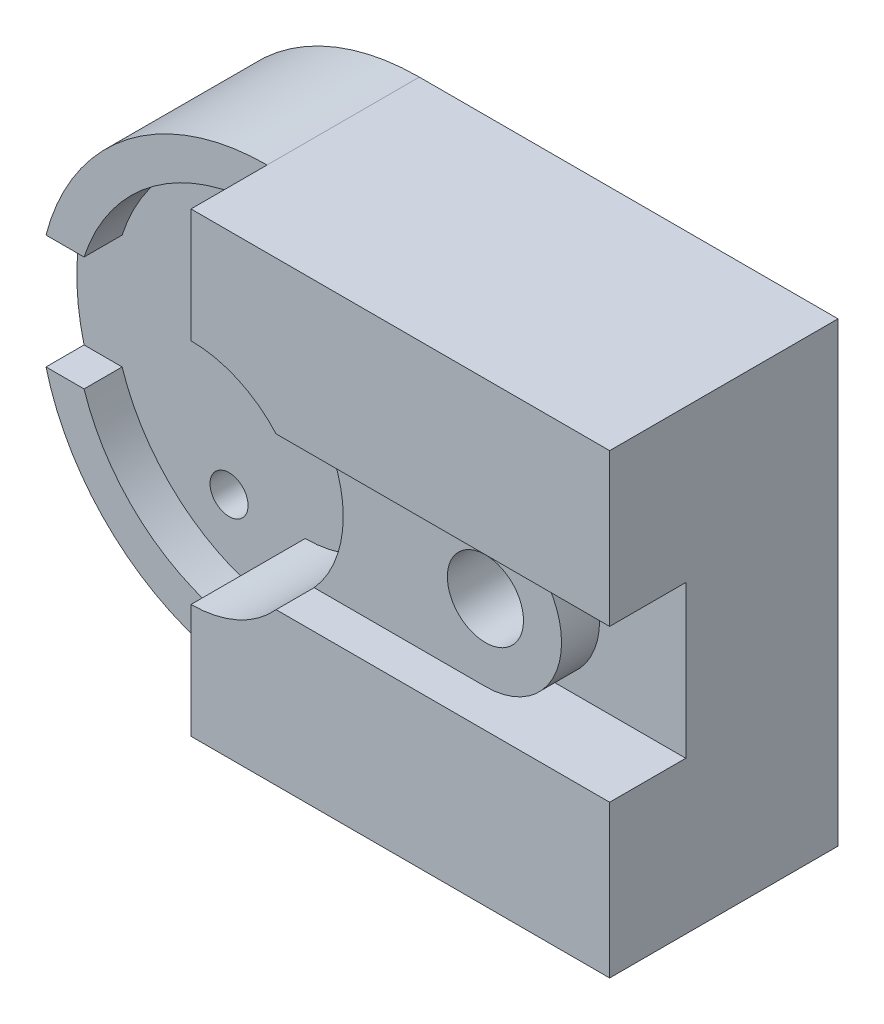
ISO-10303-21;
HEADER;
FILE_DESCRIPTION(('STEP AP214'),'2;1');
FILE_NAME('part.step','',(''),(''),'','','');
FILE_SCHEMA(('AUTOMOTIVE_DESIGN { 1 0 10303 214 1 1 1 1 }'));
ENDSEC;
DATA;
#1=APPLICATION_CONTEXT('core data for automotive mechanical design processes');
#2=APPLICATION_PROTOCOL_DEFINITION('international standard','automotive_design',2000,#1);
#3=PRODUCT_CONTEXT('',#1,'mechanical');
#4=PRODUCT('Part','Part','',(#3));
#5=PRODUCT_RELATED_PRODUCT_CATEGORY('part','',(#4));
#6=PRODUCT_DEFINITION_FORMATION('','',#4);
#7=PRODUCT_DEFINITION_CONTEXT('part definition',#1,'design');
#8=PRODUCT_DEFINITION('design','',#6,#7);
#9=PRODUCT_DEFINITION_SHAPE('','',#8);
#10=(LENGTH_UNIT() NAMED_UNIT(*) SI_UNIT(.MILLI.,.METRE.));
#11=(NAMED_UNIT(*) PLANE_ANGLE_UNIT() SI_UNIT($,.RADIAN.));
#12=(NAMED_UNIT(*) SI_UNIT($,.STERADIAN.) SOLID_ANGLE_UNIT());
#13=UNCERTAINTY_MEASURE_WITH_UNIT(LENGTH_MEASURE(1.E-05),#10,'distance_accuracy_value','');
#14=(GEOMETRIC_REPRESENTATION_CONTEXT(3) GLOBAL_UNCERTAINTY_ASSIGNED_CONTEXT((#13)) GLOBAL_UNIT_ASSIGNED_CONTEXT((#10,
#11,#12)) REPRESENTATION_CONTEXT('',''));
#15=CARTESIAN_POINT('',(0.,0.,0.));
#16=DIRECTION('',(0.,0.,1.));
#17=DIRECTION('',(1.,0.,0.));
#18=AXIS2_PLACEMENT_3D('',#15,#16,#17);
#19=CARTESIAN_POINT('',(-43.819660112501,40.,20.));
#20=DIRECTION('',(0.,1.,0.));
#21=DIRECTION('',(0.,0.,1.));
#22=AXIS2_PLACEMENT_3D('',#19,#20,#21);
#23=PLANE('',#22);
#24=DIRECTION('',(0.,0.,-1.));
#25=VECTOR('',#24,1.);
#26=CARTESIAN_POINT('',(-21.319660112501,40.,25.));
#27=LINE('',#26,#25);
#28=CARTESIAN_POINT('',(-21.319660112501,40.,25.));
#29=VERTEX_POINT('',#28);
#30=CARTESIAN_POINT('',(-21.319660112501,40.,20.));
#31=VERTEX_POINT('',#30);
#32=EDGE_CURVE('E196',#29,#31,#27,.T.);
#33=ORIENTED_EDGE('',*,*,#32,.T.);
#34=DIRECTION('',(-1.,0.,0.));
#35=VECTOR('',#34,1.);
#36=CARTESIAN_POINT('',(-43.819660112501,40.,20.));
#37=LINE('',#36,#35);
#38=CARTESIAN_POINT('',(0.,40.,20.));
#39=VERTEX_POINT('',#38);
#40=EDGE_CURVE('E190',#39,#31,#37,.T.);
#41=ORIENTED_EDGE('',*,*,#40,.F.);
#42=DIRECTION('',(0.,0.,1.));
#43=VECTOR('',#42,1.);
#44=CARTESIAN_POINT('',(0.,40.,20.));
#45=LINE('',#44,#43);
#46=CARTESIAN_POINT('',(0.,40.,30.));
#47=VERTEX_POINT('',#46);
#48=EDGE_CURVE('E184',#39,#47,#45,.T.);
#49=ORIENTED_EDGE('',*,*,#48,.T.);
#50=DIRECTION('',(-1.,0.,0.));
#51=VECTOR('',#50,1.);
#52=CARTESIAN_POINT('',(-43.819660112501,40.,30.));
#53=LINE('',#52,#51);
#54=CARTESIAN_POINT('',(-43.819660112501,40.,30.));
#55=VERTEX_POINT('',#54);
#56=EDGE_CURVE('E174',#47,#55,#53,.T.);
#57=ORIENTED_EDGE('',*,*,#56,.T.);
#58=DIRECTION('',(0.,0.,1.));
#59=VECTOR('',#58,1.);
#60=CARTESIAN_POINT('',(-43.819660112501,40.,20.));
#61=LINE('',#60,#59);
#62=CARTESIAN_POINT('',(-43.819660112501,40.,25.));
#63=VERTEX_POINT('',#62);
#64=EDGE_CURVE('E55',#63,#55,#61,.T.);
#65=ORIENTED_EDGE('',*,*,#64,.F.);
#66=DIRECTION('',(-1.,0.,0.));
#67=VECTOR('',#66,1.);
#68=CARTESIAN_POINT('',(-43.819660112501,40.,25.));
#69=LINE('',#68,#67);
#70=EDGE_CURVE('E50',#29,#63,#69,.T.);
#71=ORIENTED_EDGE('',*,*,#70,.F.);
#72=EDGE_LOOP('',(#33,#41,#49,#57,#65,#71));
#73=FACE_BOUND('',#72,.T.);
#74=ADVANCED_FACE('F33',(#73),#23,.F.);
#75=CARTESIAN_POINT('',(-55.,30.,20.));
#76=DIRECTION('',(0.,0.,-1.));
#77=DIRECTION('',(-1.,0.,0.));
#78=AXIS2_PLACEMENT_3D('',#75,#76,#77);
#79=PLANE('',#78);
#80=CARTESIAN_POINT('',(-21.319660112501,30.,20.));
#81=DIRECTION('',(0.,0.,1.));
#82=DIRECTION('',(-1.,0.,0.));
#83=AXIS2_PLACEMENT_3D('',#80,#81,#82);
#84=CIRCLE('',#83,10.);
#85=CARTESIAN_POINT('',(-21.319660112501,20.,20.));
#86=VERTEX_POINT('',#85);
#87=EDGE_CURVE('E171',#86,#31,#84,.T.);
#88=ORIENTED_EDGE('',*,*,#87,.F.);
#89=DIRECTION('',(1.,0.,0.));
#90=VECTOR('',#89,1.);
#91=CARTESIAN_POINT('',(-43.819660112501,20.,20.));
#92=LINE('',#91,#90);
#93=CARTESIAN_POINT('',(0.,20.,20.));
#94=VERTEX_POINT('',#93);
#95=EDGE_CURVE('E163',#86,#94,#92,.T.);
#96=ORIENTED_EDGE('',*,*,#95,.T.);
#97=DIRECTION('',(0.,1.,0.));
#98=VECTOR('',#97,1.);
#99=CARTESIAN_POINT('',(0.,20.,20.));
#100=LINE('',#99,#98);
#101=EDGE_CURVE('E168',#94,#39,#100,.T.);
#102=ORIENTED_EDGE('',*,*,#101,.T.);
#103=ORIENTED_EDGE('',*,*,#40,.T.);
#104=EDGE_LOOP('',(#88,#96,#102,#103));
#105=FACE_BOUND('',#104,.T.);
#106=ADVANCED_FACE('F165',(#105),#79,.F.);
#107=CARTESIAN_POINT('',(-55.,30.,30.));
#108=DIRECTION('',(0.,0.,1.));
#109=DIRECTION('',(1.,0.,0.));
#110=AXIS2_PLACEMENT_3D('',#107,#108,#109);
#111=PLANE('',#110);
#112=ORIENTED_EDGE('',*,*,#56,.F.);
#113=DIRECTION('',(0.,1.,0.));
#114=VECTOR('',#113,1.);
#115=CARTESIAN_POINT('',(0.,60.,30.));
#116=LINE('',#115,#114);
#117=CARTESIAN_POINT('',(0.,60.,30.));
#118=VERTEX_POINT('',#117);
#119=EDGE_CURVE('E217',#47,#118,#116,.T.);
#120=ORIENTED_EDGE('',*,*,#119,.T.);
#121=DIRECTION('',(-1.,0.,0.));
#122=VECTOR('',#121,1.);
#123=CARTESIAN_POINT('',(0.,60.,30.));
#124=LINE('',#123,#122);
#125=CARTESIAN_POINT('',(-55.,60.,30.));
#126=VERTEX_POINT('',#125);
#127=EDGE_CURVE('E202',#118,#126,#124,.T.);
#128=ORIENTED_EDGE('',*,*,#127,.T.);
#129=DIRECTION('',(0.,-1.,0.));
#130=VECTOR('',#129,1.);
#131=CARTESIAN_POINT('',(-55.,60.,30.));
#132=LINE('',#131,#130);
#133=CARTESIAN_POINT('',(-55.,45.,30.));
#134=VERTEX_POINT('',#133);
#135=EDGE_CURVE('E205',#126,#134,#132,.T.);
#136=ORIENTED_EDGE('',*,*,#135,.T.);
#137=CARTESIAN_POINT('',(-55.,30.,30.));
#138=DIRECTION('',(0.,0.,-1.));
#139=DIRECTION('',(1.,0.,0.));
#140=AXIS2_PLACEMENT_3D('',#137,#138,#139);
#141=CIRCLE('',#140,15.);
#142=EDGE_CURVE('E209',#134,#55,#141,.T.);
#143=ORIENTED_EDGE('',*,*,#142,.T.);
#144=EDGE_LOOP('',(#112,#120,#128,#136,#143));
#145=FACE_BOUND('',#144,.T.);
#146=ADVANCED_FACE('F373',(#145),#111,.T.);
#147=CARTESIAN_POINT('',(-55.,30.,15.));
#148=DIRECTION('',(0.,0.,1.));
#149=DIRECTION('',(1.,0.,0.));
#150=AXIS2_PLACEMENT_3D('',#147,#148,#149);
#151=PLANE('',#150);
#152=CARTESIAN_POINT('',(-65.,45.,15.));
#153=DIRECTION('',(0.,0.,1.));
#154=DIRECTION('',(1.,0.,0.));
#155=AXIS2_PLACEMENT_3D('',#152,#153,#154);
#156=CIRCLE('',#155,2.5);
#157=CARTESIAN_POINT('',(-62.5,45.,15.));
#158=VERTEX_POINT('',#157);
#159=EDGE_CURVE('E315',#158,#158,#156,.T.);
#160=ORIENTED_EDGE('',*,*,#159,.F.);
#161=EDGE_LOOP('',(#160));
#162=FACE_BOUND('',#161,.T.);
#163=CARTESIAN_POINT('',(-65.,15.,15.));
#164=DIRECTION('',(0.,0.,1.));
#165=DIRECTION('',(1.,0.,0.));
#166=AXIS2_PLACEMENT_3D('',#163,#164,#165);
#167=CIRCLE('',#166,2.5);
#168=CARTESIAN_POINT('',(-62.5,15.,15.));
#169=VERTEX_POINT('',#168);
#170=EDGE_CURVE('E305',#169,#169,#167,.T.);
#171=ORIENTED_EDGE('',*,*,#170,.F.);
#172=EDGE_LOOP('',(#171));
#173=FACE_BOUND('',#172,.T.);
#174=CARTESIAN_POINT('',(-55.,30.,15.));
#175=DIRECTION('',(0.,0.,1.));
#176=DIRECTION('',(1.,0.,0.));
#177=AXIS2_PLACEMENT_3D('',#174,#175,#176);
#178=CIRCLE('',#177,5.);
#179=CARTESIAN_POINT('',(-50.,30.,15.));
#180=VERTEX_POINT('',#179);
#181=EDGE_CURVE('E302',#180,#180,#178,.T.);
#182=ORIENTED_EDGE('',*,*,#181,.F.);
#183=EDGE_LOOP('',(#182));
#184=FACE_BOUND('',#183,.T.);
#185=CARTESIAN_POINT('',(-55.,30.,15.));
#186=DIRECTION('',(0.,0.,-1.));
#187=DIRECTION('',(1.,0.,0.));
#188=AXIS2_PLACEMENT_3D('',#185,#186,#187);
#189=CIRCLE('',#188,15.);
#190=CARTESIAN_POINT('',(-55.,45.,15.));
#191=VERTEX_POINT('',#190);
#192=CARTESIAN_POINT('',(-55.,15.,15.));
#193=VERTEX_POINT('',#192);
#194=EDGE_CURVE('E222',#191,#193,#189,.T.);
#195=ORIENTED_EDGE('',*,*,#194,.F.);
#196=DIRECTION('',(0.,-1.,0.));
#197=VECTOR('',#196,1.);
#198=CARTESIAN_POINT('',(-55.,60.,15.));
#199=LINE('',#198,#197);
#200=CARTESIAN_POINT('',(-55.,55.,15.));
#201=VERTEX_POINT('',#200);
#202=EDGE_CURVE('E199',#201,#191,#199,.T.);
#203=ORIENTED_EDGE('',*,*,#202,.F.);
#204=CARTESIAN_POINT('',(-55.,29.7278214561587,15.));
#205=DIRECTION('',(0.,0.,-1.));
#206=DIRECTION('',(-1.,0.,0.));
#207=AXIS2_PLACEMENT_3D('',#204,#205,#206);
#208=CIRCLE('',#207,25.2721785438413);
#209=CARTESIAN_POINT('',(-79.0473750965556,37.5,15.));
#210=VERTEX_POINT('',#209);
#211=EDGE_CURVE('E264',#210,#201,#208,.T.);
#212=ORIENTED_EDGE('',*,*,#211,.F.);
#213=DIRECTION('',(1.,0.,0.));
#214=VECTOR('',#213,1.);
#215=CARTESIAN_POINT('',(-84.0473750965556,37.5,15.));
#216=LINE('',#215,#214);
#217=CARTESIAN_POINT('',(-84.0473750965556,37.5,15.));
#218=VERTEX_POINT('',#217);
#219=EDGE_CURVE('E259',#218,#210,#216,.T.);
#220=ORIENTED_EDGE('',*,*,#219,.F.);
#221=CARTESIAN_POINT('',(-55.,30.,15.));
#222=DIRECTION('',(0.,0.,1.));
#223=DIRECTION('',(1.,0.,0.));
#224=AXIS2_PLACEMENT_3D('',#221,#222,#223);
#225=CIRCLE('',#224,30.);
#226=CARTESIAN_POINT('',(-84.0473750965556,22.5,15.));
#227=VERTEX_POINT('',#226);
#228=EDGE_CURVE('E285',#218,#227,#225,.T.);
#229=ORIENTED_EDGE('',*,*,#228,.T.);
#230=DIRECTION('',(-1.,0.,0.));
#231=VECTOR('',#230,1.);
#232=CARTESIAN_POINT('',(-84.0473750965556,22.5,15.));
#233=LINE('',#232,#231);
#234=CARTESIAN_POINT('',(-79.0473750965556,22.5,15.));
#235=VERTEX_POINT('',#234);
#236=EDGE_CURVE('E241',#235,#227,#233,.T.);
#237=ORIENTED_EDGE('',*,*,#236,.F.);
#238=CARTESIAN_POINT('',(-55.,30.2721785438412,15.));
#239=DIRECTION('',(0.,0.,-1.));
#240=DIRECTION('',(1.,0.,0.));
#241=AXIS2_PLACEMENT_3D('',#238,#239,#240);
#242=CIRCLE('',#241,25.2721785438412);
#243=CARTESIAN_POINT('',(-55.,5.,15.));
#244=VERTEX_POINT('',#243);
#245=EDGE_CURVE('E236',#244,#235,#242,.T.);
#246=ORIENTED_EDGE('',*,*,#245,.F.);
#247=DIRECTION('',(0.,-1.,0.));
#248=VECTOR('',#247,1.);
#249=CARTESIAN_POINT('',(-55.,0.,15.));
#250=LINE('',#249,#248);
#251=EDGE_CURVE('E206',#193,#244,#250,.T.);
#252=ORIENTED_EDGE('',*,*,#251,.F.);
#253=EDGE_LOOP('',(#195,#203,#212,#220,#229,#237,#246,#252));
#254=FACE_BOUND('',#253,.T.);
#255=ADVANCED_FACE('F380',(#162,#173,#184,#254),#151,.T.);
#256=CARTESIAN_POINT('',(-55.,30.,15.));
#257=DIRECTION('',(0.,0.,-1.));
#258=DIRECTION('',(-1.,0.,0.));
#259=AXIS2_PLACEMENT_3D('',#256,#257,#258);
#260=CYLINDRICAL_SURFACE('',#259,30.);
#261=CARTESIAN_POINT('',(-55.,30.,0.));
#262=DIRECTION('',(0.,0.,1.));
#263=DIRECTION('',(1.,0.,0.));
#264=AXIS2_PLACEMENT_3D('',#261,#262,#263);
#265=CIRCLE('',#264,30.);
#266=CARTESIAN_POINT('',(-55.,60.,0.));
#267=VERTEX_POINT('',#266);
#268=CARTESIAN_POINT('',(-55.,0.,0.));
#269=VERTEX_POINT('',#268);
#270=EDGE_CURVE('E282',#267,#269,#265,.T.);
#271=ORIENTED_EDGE('',*,*,#270,.T.);
#272=DIRECTION('',(0.,0.,-1.));
#273=VECTOR('',#272,1.);
#274=CARTESIAN_POINT('',(-55.,0.,15.));
#275=LINE('',#274,#273);
#276=CARTESIAN_POINT('',(-55.,0.,20.));
#277=VERTEX_POINT('',#276);
#278=EDGE_CURVE('E11',#277,#269,#275,.T.);
#279=ORIENTED_EDGE('',*,*,#278,.F.);
#280=CARTESIAN_POINT('',(-54.9999999999998,30.0000000000002,20.));
#281=DIRECTION('',(0.,0.,1.));
#282=DIRECTION('',(1.,0.,0.));
#283=AXIS2_PLACEMENT_3D('',#280,#281,#282);
#284=CIRCLE('',#283,30.0000000000002);
#285=CARTESIAN_POINT('',(-84.0473750965556,22.5,20.));
#286=VERTEX_POINT('',#285);
#287=EDGE_CURVE('E237',#286,#277,#284,.T.);
#288=ORIENTED_EDGE('',*,*,#287,.F.);
#289=DIRECTION('',(0.,0.,-1.));
#290=VECTOR('',#289,1.);
#291=CARTESIAN_POINT('',(-84.0473750965556,22.5,20.));
#292=LINE('',#291,#290);
#293=EDGE_CURVE('E248',#286,#227,#292,.T.);
#294=ORIENTED_EDGE('',*,*,#293,.T.);
#295=ORIENTED_EDGE('',*,*,#228,.F.);
#296=DIRECTION('',(0.,0.,-1.));
#297=VECTOR('',#296,1.);
#298=CARTESIAN_POINT('',(-84.0473750965556,37.5,20.));
#299=LINE('',#298,#297);
#300=CARTESIAN_POINT('',(-84.0473750965556,37.5,20.));
#301=VERTEX_POINT('',#300);
#302=EDGE_CURVE('E279',#301,#218,#299,.T.);
#303=ORIENTED_EDGE('',*,*,#302,.F.);
#304=CARTESIAN_POINT('',(-54.9999999999998,29.9999999999997,20.));
#305=DIRECTION('',(0.,0.,1.));
#306=DIRECTION('',(-1.,0.,0.));
#307=AXIS2_PLACEMENT_3D('',#304,#305,#306);
#308=CIRCLE('',#307,30.0000000000003);
#309=CARTESIAN_POINT('',(-55.,60.,20.));
#310=VERTEX_POINT('',#309);
#311=EDGE_CURVE('E260',#310,#301,#308,.T.);
#312=ORIENTED_EDGE('',*,*,#311,.F.);
#313=DIRECTION('',(0.,0.,-1.));
#314=VECTOR('',#313,1.);
#315=CARTESIAN_POINT('',(-55.,60.,15.));
#316=LINE('',#315,#314);
#317=EDGE_CURVE('E288',#310,#267,#316,.T.);
#318=ORIENTED_EDGE('',*,*,#317,.T.);
#319=EDGE_LOOP('',(#271,#279,#288,#294,#295,#303,#312,#318));
#320=FACE_BOUND('',#319,.T.);
#321=ADVANCED_FACE('F35',(#320),#260,.T.);
#322=CARTESIAN_POINT('',(-55.,0.,15.));
#323=DIRECTION('',(0.,1.,0.));
#324=DIRECTION('',(0.,0.,1.));
#325=AXIS2_PLACEMENT_3D('',#322,#323,#324);
#326=PLANE('',#325);
#327=DIRECTION('',(1.,0.,0.));
#328=VECTOR('',#327,1.);
#329=CARTESIAN_POINT('',(-55.,0.,0.));
#330=LINE('',#329,#328);
#331=CARTESIAN_POINT('',(0.,0.,0.));
#332=VERTEX_POINT('',#331);
#333=EDGE_CURVE('E361',#269,#332,#330,.T.);
#334=ORIENTED_EDGE('',*,*,#333,.T.);
#335=DIRECTION('',(0.,0.,-1.));
#336=VECTOR('',#335,1.);
#337=CARTESIAN_POINT('',(0.,0.,15.));
#338=LINE('',#337,#336);
#339=CARTESIAN_POINT('',(0.,0.,30.));
#340=VERTEX_POINT('',#339);
#341=EDGE_CURVE('E42',#340,#332,#338,.T.);
#342=ORIENTED_EDGE('',*,*,#341,.F.);
#343=DIRECTION('',(1.,0.,0.));
#344=VECTOR('',#343,1.);
#345=CARTESIAN_POINT('',(-55.,0.,30.));
#346=LINE('',#345,#344);
#347=CARTESIAN_POINT('',(-55.,0.,30.));
#348=VERTEX_POINT('',#347);
#349=EDGE_CURVE('E214',#348,#340,#346,.T.);
#350=ORIENTED_EDGE('',*,*,#349,.F.);
#351=DIRECTION('',(0.,0.,-1.));
#352=VECTOR('',#351,1.);
#353=CARTESIAN_POINT('',(-55.,0.,30.));
#354=LINE('',#353,#352);
#355=EDGE_CURVE('E220',#348,#277,#354,.T.);
#356=ORIENTED_EDGE('',*,*,#355,.T.);
#357=ORIENTED_EDGE('',*,*,#278,.T.);
#358=EDGE_LOOP('',(#334,#342,#350,#356,#357));
#359=FACE_BOUND('',#358,.T.);
#360=ADVANCED_FACE('F397',(#359),#326,.F.);
#361=CARTESIAN_POINT('',(0.,0.,15.));
#362=DIRECTION('',(-1.,0.,0.));
#363=DIRECTION('',(0.,0.,1.));
#364=AXIS2_PLACEMENT_3D('',#361,#362,#363);
#365=PLANE('',#364);
#366=ORIENTED_EDGE('',*,*,#119,.F.);
#367=ORIENTED_EDGE('',*,*,#48,.F.);
#368=ORIENTED_EDGE('',*,*,#101,.F.);
#369=DIRECTION('',(0.,0.,1.));
#370=VECTOR('',#369,1.);
#371=CARTESIAN_POINT('',(0.,20.,20.));
#372=LINE('',#371,#370);
#373=CARTESIAN_POINT('',(0.,20.,30.));
#374=VERTEX_POINT('',#373);
#375=EDGE_CURVE('E177',#94,#374,#372,.T.);
#376=ORIENTED_EDGE('',*,*,#375,.T.);
#377=EDGE_CURVE('E218',#340,#374,#116,.T.);
#378=ORIENTED_EDGE('',*,*,#377,.F.);
#379=ORIENTED_EDGE('',*,*,#341,.T.);
#380=DIRECTION('',(0.,1.,0.));
#381=VECTOR('',#380,1.);
#382=CARTESIAN_POINT('',(0.,0.,0.));
#383=LINE('',#382,#381);
#384=CARTESIAN_POINT('',(0.,60.,0.));
#385=VERTEX_POINT('',#384);
#386=EDGE_CURVE('E353',#332,#385,#383,.T.);
#387=ORIENTED_EDGE('',*,*,#386,.T.);
#388=DIRECTION('',(0.,0.,-1.));
#389=VECTOR('',#388,1.);
#390=CARTESIAN_POINT('',(0.,60.,15.));
#391=LINE('',#390,#389);
#392=EDGE_CURVE('E356',#118,#385,#391,.T.);
#393=ORIENTED_EDGE('',*,*,#392,.F.);
#394=EDGE_LOOP('',(#366,#367,#368,#376,#378,#379,#387,#393));
#395=FACE_BOUND('',#394,.T.);
#396=ADVANCED_FACE('F189',(#395),#365,.F.);
#397=CARTESIAN_POINT('',(0.,60.,15.));
#398=DIRECTION('',(0.,-1.,0.));
#399=DIRECTION('',(0.,0.,-1.));
#400=AXIS2_PLACEMENT_3D('',#397,#398,#399);
#401=PLANE('',#400);
#402=DIRECTION('',(-1.,0.,0.));
#403=VECTOR('',#402,1.);
#404=CARTESIAN_POINT('',(0.,60.,0.));
#405=LINE('',#404,#403);
#406=EDGE_CURVE('E289',#385,#267,#405,.T.);
#407=ORIENTED_EDGE('',*,*,#406,.T.);
#408=ORIENTED_EDGE('',*,*,#317,.F.);
#409=DIRECTION('',(0.,0.,-1.));
#410=VECTOR('',#409,1.);
#411=CARTESIAN_POINT('',(-55.,60.,30.));
#412=LINE('',#411,#410);
#413=EDGE_CURVE('E233',#126,#310,#412,.T.);
#414=ORIENTED_EDGE('',*,*,#413,.F.);
#415=ORIENTED_EDGE('',*,*,#127,.F.);
#416=ORIENTED_EDGE('',*,*,#392,.T.);
#417=EDGE_LOOP('',(#407,#408,#414,#415,#416));
#418=FACE_BOUND('',#417,.T.);
#419=ADVANCED_FACE('F369',(#418),#401,.F.);
#420=CARTESIAN_POINT('',(-55.,30.,0.));
#421=DIRECTION('',(0.,0.,1.));
#422=DIRECTION('',(1.,0.,0.));
#423=AXIS2_PLACEMENT_3D('',#420,#421,#422);
#424=PLANE('',#423);
#425=CARTESIAN_POINT('',(-65.,45.,0.));
#426=DIRECTION('',(0.,0.,1.));
#427=DIRECTION('',(1.,0.,0.));
#428=AXIS2_PLACEMENT_3D('',#425,#426,#427);
#429=CIRCLE('',#428,2.5);
#430=CARTESIAN_POINT('',(-62.5,45.,0.));
#431=VERTEX_POINT('',#430);
#432=EDGE_CURVE('E37',#431,#431,#429,.T.);
#433=ORIENTED_EDGE('',*,*,#432,.T.);
#434=EDGE_LOOP('',(#433));
#435=FACE_BOUND('',#434,.T.);
#436=CARTESIAN_POINT('',(-65.,15.,0.));
#437=DIRECTION('',(0.,0.,1.));
#438=DIRECTION('',(1.,0.,0.));
#439=AXIS2_PLACEMENT_3D('',#436,#437,#438);
#440=CIRCLE('',#439,2.5);
#441=CARTESIAN_POINT('',(-62.5,15.,0.));
#442=VERTEX_POINT('',#441);
#443=EDGE_CURVE('E303',#442,#442,#440,.T.);
#444=ORIENTED_EDGE('',*,*,#443,.T.);
#445=EDGE_LOOP('',(#444));
#446=FACE_BOUND('',#445,.T.);
#447=CARTESIAN_POINT('',(-55.,30.,0.));
#448=DIRECTION('',(0.,0.,1.));
#449=DIRECTION('',(1.,0.,0.));
#450=AXIS2_PLACEMENT_3D('',#447,#448,#449);
#451=CIRCLE('',#450,5.);
#452=CARTESIAN_POINT('',(-50.,30.,0.));
#453=VERTEX_POINT('',#452);
#454=EDGE_CURVE('E299',#453,#453,#451,.T.);
#455=ORIENTED_EDGE('',*,*,#454,.T.);
#456=EDGE_LOOP('',(#455));
#457=FACE_BOUND('',#456,.T.);
#458=CARTESIAN_POINT('',(-21.319660112501,30.,0.));
#459=DIRECTION('',(0.,0.,1.));
#460=DIRECTION('',(1.,0.,0.));
#461=AXIS2_PLACEMENT_3D('',#458,#459,#460);
#462=CIRCLE('',#461,5.);
#463=CARTESIAN_POINT('',(-16.319660112501,30.,0.));
#464=VERTEX_POINT('',#463);
#465=EDGE_CURVE('E320',#464,#464,#462,.T.);
#466=ORIENTED_EDGE('',*,*,#465,.T.);
#467=EDGE_LOOP('',(#466));
#468=FACE_BOUND('',#467,.T.);
#469=ORIENTED_EDGE('',*,*,#270,.F.);
#470=ORIENTED_EDGE('',*,*,#406,.F.);
#471=ORIENTED_EDGE('',*,*,#386,.F.);
#472=ORIENTED_EDGE('',*,*,#333,.F.);
#473=EDGE_LOOP('',(#469,#470,#471,#472));
#474=FACE_BOUND('',#473,.T.);
#475=ADVANCED_FACE('F360',(#435,#446,#457,#468,#474),#424,.F.);
#476=CARTESIAN_POINT('',(-84.0473750965556,37.5,20.));
#477=DIRECTION('',(0.,1.,0.));
#478=DIRECTION('',(0.,0.,1.));
#479=AXIS2_PLACEMENT_3D('',#476,#477,#478);
#480=PLANE('',#479);
#481=ORIENTED_EDGE('',*,*,#219,.T.);
#482=DIRECTION('',(0.,0.,-1.));
#483=VECTOR('',#482,1.);
#484=CARTESIAN_POINT('',(-79.0473750965556,37.5,20.));
#485=LINE('',#484,#483);
#486=CARTESIAN_POINT('',(-79.0473750965556,37.5,20.));
#487=VERTEX_POINT('',#486);
#488=EDGE_CURVE('E276',#487,#210,#485,.T.);
#489=ORIENTED_EDGE('',*,*,#488,.F.);
#490=DIRECTION('',(1.,0.,0.));
#491=VECTOR('',#490,1.);
#492=CARTESIAN_POINT('',(-84.0473750965556,37.5,20.));
#493=LINE('',#492,#491);
#494=EDGE_CURVE('E263',#301,#487,#493,.T.);
#495=ORIENTED_EDGE('',*,*,#494,.F.);
#496=ORIENTED_EDGE('',*,*,#302,.T.);
#497=EDGE_LOOP('',(#481,#489,#495,#496));
#498=FACE_BOUND('',#497,.T.);
#499=ADVANCED_FACE('F412',(#498),#480,.F.);
#500=CARTESIAN_POINT('',(-55.,29.7278214561587,20.));
#501=DIRECTION('',(0.,0.,-1.));
#502=DIRECTION('',(-1.,0.,0.));
#503=AXIS2_PLACEMENT_3D('',#500,#501,#502);
#504=CYLINDRICAL_SURFACE('',#503,25.2721785438413);
#505=ORIENTED_EDGE('',*,*,#211,.T.);
#506=DIRECTION('',(0.,0.,-1.));
#507=VECTOR('',#506,1.);
#508=CARTESIAN_POINT('',(-55.,55.,20.));
#509=LINE('',#508,#507);
#510=CARTESIAN_POINT('',(-55.,55.,20.));
#511=VERTEX_POINT('',#510);
#512=EDGE_CURVE('E272',#511,#201,#509,.T.);
#513=ORIENTED_EDGE('',*,*,#512,.F.);
#514=CARTESIAN_POINT('',(-55.,29.7278214561587,20.));
#515=DIRECTION('',(0.,0.,-1.));
#516=DIRECTION('',(-1.,0.,0.));
#517=AXIS2_PLACEMENT_3D('',#514,#515,#516);
#518=CIRCLE('',#517,25.2721785438413);
#519=EDGE_CURVE('E266',#487,#511,#518,.T.);
#520=ORIENTED_EDGE('',*,*,#519,.F.);
#521=ORIENTED_EDGE('',*,*,#488,.T.);
#522=EDGE_LOOP('',(#505,#513,#520,#521));
#523=FACE_BOUND('',#522,.T.);
#524=ADVANCED_FACE('F409',(#523),#504,.F.);
#525=CARTESIAN_POINT('',(-54.9999999999998,29.9999999999997,20.));
#526=DIRECTION('',(0.,0.,-1.));
#527=DIRECTION('',(-1.,0.,0.));
#528=AXIS2_PLACEMENT_3D('',#525,#526,#527);
#529=PLANE('',#528);
#530=ORIENTED_EDGE('',*,*,#311,.T.);
#531=ORIENTED_EDGE('',*,*,#494,.T.);
#532=ORIENTED_EDGE('',*,*,#519,.T.);
#533=DIRECTION('',(0.,1.,0.));
#534=VECTOR('',#533,1.);
#535=CARTESIAN_POINT('',(-55.0000000000001,60.,20.));
#536=LINE('',#535,#534);
#537=EDGE_CURVE('E269',#511,#310,#536,.T.);
#538=ORIENTED_EDGE('',*,*,#537,.T.);
#539=EDGE_LOOP('',(#530,#531,#532,#538));
#540=FACE_BOUND('',#539,.T.);
#541=ADVANCED_FACE('F404',(#540),#529,.F.);
#542=CARTESIAN_POINT('',(-55.,30.2721785438412,20.));
#543=DIRECTION('',(0.,0.,-1.));
#544=DIRECTION('',(-1.,0.,0.));
#545=AXIS2_PLACEMENT_3D('',#542,#543,#544);
#546=CYLINDRICAL_SURFACE('',#545,25.2721785438412);
#547=ORIENTED_EDGE('',*,*,#245,.T.);
#548=DIRECTION('',(0.,0.,-1.));
#549=VECTOR('',#548,1.);
#550=CARTESIAN_POINT('',(-79.0473750965556,22.5,20.));
#551=LINE('',#550,#549);
#552=CARTESIAN_POINT('',(-79.0473750965556,22.5,20.));
#553=VERTEX_POINT('',#552);
#554=EDGE_CURVE('E254',#553,#235,#551,.T.);
#555=ORIENTED_EDGE('',*,*,#554,.F.);
#556=CARTESIAN_POINT('',(-55.,30.2721785438412,20.));
#557=DIRECTION('',(0.,0.,-1.));
#558=DIRECTION('',(1.,0.,0.));
#559=AXIS2_PLACEMENT_3D('',#556,#557,#558);
#560=CIRCLE('',#559,25.2721785438412);
#561=CARTESIAN_POINT('',(-55.,5.,20.));
#562=VERTEX_POINT('',#561);
#563=EDGE_CURVE('E244',#562,#553,#560,.T.);
#564=ORIENTED_EDGE('',*,*,#563,.F.);
#565=DIRECTION('',(0.,0.,-1.));
#566=VECTOR('',#565,1.);
#567=CARTESIAN_POINT('',(-55.,5.,20.));
#568=LINE('',#567,#566);
#569=EDGE_CURVE('E256',#562,#244,#568,.T.);
#570=ORIENTED_EDGE('',*,*,#569,.T.);
#571=EDGE_LOOP('',(#547,#555,#564,#570));
#572=FACE_BOUND('',#571,.T.);
#573=ADVANCED_FACE('F389',(#572),#546,.F.);
#574=CARTESIAN_POINT('',(-84.0473750965556,22.5,20.));
#575=DIRECTION('',(0.,-1.,0.));
#576=DIRECTION('',(0.,0.,-1.));
#577=AXIS2_PLACEMENT_3D('',#574,#575,#576);
#578=PLANE('',#577);
#579=ORIENTED_EDGE('',*,*,#236,.T.);
#580=ORIENTED_EDGE('',*,*,#293,.F.);
#581=DIRECTION('',(-1.,0.,0.));
#582=VECTOR('',#581,1.);
#583=CARTESIAN_POINT('',(-84.0473750965556,22.5,20.));
#584=LINE('',#583,#582);
#585=EDGE_CURVE('E246',#553,#286,#584,.T.);
#586=ORIENTED_EDGE('',*,*,#585,.F.);
#587=ORIENTED_EDGE('',*,*,#554,.T.);
#588=EDGE_LOOP('',(#579,#580,#586,#587));
#589=FACE_BOUND('',#588,.T.);
#590=ADVANCED_FACE('F414',(#589),#578,.F.);
#591=CARTESIAN_POINT('',(-54.9999999999998,30.0000000000002,20.));
#592=DIRECTION('',(0.,0.,1.));
#593=DIRECTION('',(1.,0.,0.));
#594=AXIS2_PLACEMENT_3D('',#591,#592,#593);
#595=PLANE('',#594);
#596=ORIENTED_EDGE('',*,*,#287,.T.);
#597=DIRECTION('',(0.,1.,0.));
#598=VECTOR('',#597,1.);
#599=CARTESIAN_POINT('',(-55.,0.,20.));
#600=LINE('',#599,#598);
#601=EDGE_CURVE('E240',#277,#562,#600,.T.);
#602=ORIENTED_EDGE('',*,*,#601,.T.);
#603=ORIENTED_EDGE('',*,*,#563,.T.);
#604=ORIENTED_EDGE('',*,*,#585,.T.);
#605=EDGE_LOOP('',(#596,#602,#603,#604));
#606=FACE_BOUND('',#605,.T.);
#607=ADVANCED_FACE('F393',(#606),#595,.T.);
#608=CARTESIAN_POINT('',(-55.,60.,30.));
#609=DIRECTION('',(1.,0.,0.));
#610=DIRECTION('',(0.,1.,0.));
#611=AXIS2_PLACEMENT_3D('',#608,#609,#610);
#612=PLANE('',#611);
#613=ORIENTED_EDGE('',*,*,#537,.F.);
#614=ORIENTED_EDGE('',*,*,#512,.T.);
#615=ORIENTED_EDGE('',*,*,#202,.T.);
#616=DIRECTION('',(0.,0.,-1.));
#617=VECTOR('',#616,1.);
#618=CARTESIAN_POINT('',(-55.,45.,30.));
#619=LINE('',#618,#617);
#620=EDGE_CURVE('E230',#134,#191,#619,.T.);
#621=ORIENTED_EDGE('',*,*,#620,.F.);
#622=ORIENTED_EDGE('',*,*,#135,.F.);
#623=ORIENTED_EDGE('',*,*,#413,.T.);
#624=EDGE_LOOP('',(#613,#614,#615,#621,#622,#623));
#625=FACE_BOUND('',#624,.T.);
#626=ADVANCED_FACE('F402',(#625),#612,.F.);
#627=CARTESIAN_POINT('',(-55.,0.,30.));
#628=DIRECTION('',(1.,0.,0.));
#629=DIRECTION('',(0.,0.,-1.));
#630=AXIS2_PLACEMENT_3D('',#627,#628,#629);
#631=PLANE('',#630);
#632=ORIENTED_EDGE('',*,*,#251,.T.);
#633=ORIENTED_EDGE('',*,*,#569,.F.);
#634=ORIENTED_EDGE('',*,*,#601,.F.);
#635=ORIENTED_EDGE('',*,*,#355,.F.);
#636=DIRECTION('',(0.,-1.,0.));
#637=VECTOR('',#636,1.);
#638=CARTESIAN_POINT('',(-55.,0.,30.));
#639=LINE('',#638,#637);
#640=CARTESIAN_POINT('',(-55.,15.,30.));
#641=VERTEX_POINT('',#640);
#642=EDGE_CURVE('E212',#641,#348,#639,.T.);
#643=ORIENTED_EDGE('',*,*,#642,.F.);
#644=DIRECTION('',(0.,0.,-1.));
#645=VECTOR('',#644,1.);
#646=CARTESIAN_POINT('',(-55.,15.,30.));
#647=LINE('',#646,#645);
#648=EDGE_CURVE('E227',#641,#193,#647,.T.);
#649=ORIENTED_EDGE('',*,*,#648,.T.);
#650=EDGE_LOOP('',(#632,#633,#634,#635,#643,#649));
#651=FACE_BOUND('',#650,.T.);
#652=ADVANCED_FACE('F384',(#651),#631,.F.);
#653=CARTESIAN_POINT('',(-55.,30.,30.));
#654=DIRECTION('',(0.,0.,-1.));
#655=DIRECTION('',(-1.,0.,0.));
#656=AXIS2_PLACEMENT_3D('',#653,#654,#655);
#657=CYLINDRICAL_SURFACE('',#656,15.);
#658=CARTESIAN_POINT('',(-55.,30.,25.));
#659=DIRECTION('',(0.,0.,-1.));
#660=DIRECTION('',(1.,0.,0.));
#661=AXIS2_PLACEMENT_3D('',#658,#659,#660);
#662=CIRCLE('',#661,15.);
#663=CARTESIAN_POINT('',(-43.819660112501,20.,25.));
#664=VERTEX_POINT('',#663);
#665=EDGE_CURVE('E326',#63,#664,#662,.T.);
#666=ORIENTED_EDGE('',*,*,#665,.F.);
#667=ORIENTED_EDGE('',*,*,#64,.T.);
#668=ORIENTED_EDGE('',*,*,#142,.F.);
#669=ORIENTED_EDGE('',*,*,#620,.T.);
#670=ORIENTED_EDGE('',*,*,#194,.T.);
#671=ORIENTED_EDGE('',*,*,#648,.F.);
#672=CARTESIAN_POINT('',(-43.819660112501,20.,30.));
#673=VERTEX_POINT('',#672);
#674=EDGE_CURVE('E208',#673,#641,#141,.T.);
#675=ORIENTED_EDGE('',*,*,#674,.F.);
#676=DIRECTION('',(0.,0.,1.));
#677=VECTOR('',#676,1.);
#678=CARTESIAN_POINT('',(-43.819660112501,20.,20.));
#679=LINE('',#678,#677);
#680=EDGE_CURVE('E185',#664,#673,#679,.T.);
#681=ORIENTED_EDGE('',*,*,#680,.F.);
#682=EDGE_LOOP('',(#666,#667,#668,#669,#670,#671,#675,#681));
#683=FACE_BOUND('',#682,.T.);
#684=ADVANCED_FACE('F343',(#683),#657,.F.);
#685=DIRECTION('',(1.,0.,0.));
#686=VECTOR('',#685,1.);
#687=CARTESIAN_POINT('',(-43.819660112501,20.,30.));
#688=LINE('',#687,#686);
#689=EDGE_CURVE('E180',#673,#374,#688,.T.);
#690=ORIENTED_EDGE('',*,*,#689,.F.);
#691=ORIENTED_EDGE('',*,*,#674,.T.);
#692=ORIENTED_EDGE('',*,*,#642,.T.);
#693=ORIENTED_EDGE('',*,*,#349,.T.);
#694=ORIENTED_EDGE('',*,*,#377,.T.);
#695=EDGE_LOOP('',(#690,#691,#692,#693,#694));
#696=FACE_BOUND('',#695,.T.);
#697=ADVANCED_FACE('F348',(#696),#111,.T.);
#698=CARTESIAN_POINT('',(-43.819660112501,20.,20.));
#699=DIRECTION('',(0.,-1.,0.));
#700=DIRECTION('',(0.,0.,-1.));
#701=AXIS2_PLACEMENT_3D('',#698,#699,#700);
#702=PLANE('',#701);
#703=ORIENTED_EDGE('',*,*,#95,.F.);
#704=DIRECTION('',(0.,0.,-1.));
#705=VECTOR('',#704,1.);
#706=CARTESIAN_POINT('',(-21.319660112501,20.,25.));
#707=LINE('',#706,#705);
#708=CARTESIAN_POINT('',(-21.319660112501,20.,25.));
#709=VERTEX_POINT('',#708);
#710=EDGE_CURVE('E332',#709,#86,#707,.T.);
#711=ORIENTED_EDGE('',*,*,#710,.F.);
#712=DIRECTION('',(1.,0.,0.));
#713=VECTOR('',#712,1.);
#714=CARTESIAN_POINT('',(-21.319660112501,20.,25.));
#715=LINE('',#714,#713);
#716=EDGE_CURVE('E329',#664,#709,#715,.T.);
#717=ORIENTED_EDGE('',*,*,#716,.F.);
#718=ORIENTED_EDGE('',*,*,#680,.T.);
#719=ORIENTED_EDGE('',*,*,#689,.T.);
#720=ORIENTED_EDGE('',*,*,#375,.F.);
#721=EDGE_LOOP('',(#703,#711,#717,#718,#719,#720));
#722=FACE_BOUND('',#721,.T.);
#723=ADVANCED_FACE('F178',(#722),#702,.F.);
#724=CARTESIAN_POINT('',(-21.319660112501,30.,25.));
#725=DIRECTION('',(0.,0.,-1.));
#726=DIRECTION('',(-1.,0.,0.));
#727=AXIS2_PLACEMENT_3D('',#724,#725,#726);
#728=CYLINDRICAL_SURFACE('',#727,10.);
#729=ORIENTED_EDGE('',*,*,#87,.T.);
#730=ORIENTED_EDGE('',*,*,#32,.F.);
#731=CARTESIAN_POINT('',(-21.319660112501,30.,25.));
#732=DIRECTION('',(0.,0.,1.));
#733=DIRECTION('',(-1.,0.,0.));
#734=AXIS2_PLACEMENT_3D('',#731,#732,#733);
#735=CIRCLE('',#734,10.);
#736=EDGE_CURVE('E323',#709,#29,#735,.T.);
#737=ORIENTED_EDGE('',*,*,#736,.F.);
#738=ORIENTED_EDGE('',*,*,#710,.T.);
#739=EDGE_LOOP('',(#729,#730,#737,#738));
#740=FACE_BOUND('',#739,.T.);
#741=ADVANCED_FACE('F337',(#740),#728,.T.);
#742=CARTESIAN_POINT('',(-21.319660112501,30.,25.));
#743=DIRECTION('',(0.,0.,-1.));
#744=DIRECTION('',(-1.,0.,0.));
#745=AXIS2_PLACEMENT_3D('',#742,#743,#744);
#746=PLANE('',#745);
#747=CARTESIAN_POINT('',(-21.319660112501,30.,25.));
#748=DIRECTION('',(0.,0.,1.));
#749=DIRECTION('',(1.,0.,0.));
#750=AXIS2_PLACEMENT_3D('',#747,#748,#749);
#751=CIRCLE('',#750,5.);
#752=CARTESIAN_POINT('',(-16.319660112501,30.,25.));
#753=VERTEX_POINT('',#752);
#754=EDGE_CURVE('E301',#753,#753,#751,.T.);
#755=ORIENTED_EDGE('',*,*,#754,.F.);
#756=EDGE_LOOP('',(#755));
#757=FACE_BOUND('',#756,.T.);
#758=ORIENTED_EDGE('',*,*,#736,.T.);
#759=ORIENTED_EDGE('',*,*,#70,.T.);
#760=ORIENTED_EDGE('',*,*,#665,.T.);
#761=ORIENTED_EDGE('',*,*,#716,.T.);
#762=EDGE_LOOP('',(#758,#759,#760,#761));
#763=FACE_BOUND('',#762,.T.);
#764=ADVANCED_FACE('F340',(#757,#763),#746,.F.);
#765=CARTESIAN_POINT('',(-21.319660112501,30.,-29.));
#766=DIRECTION('',(0.,0.,1.));
#767=DIRECTION('',(1.,0.,0.));
#768=AXIS2_PLACEMENT_3D('',#765,#766,#767);
#769=CYLINDRICAL_SURFACE('',#768,5.);
#770=ORIENTED_EDGE('',*,*,#754,.T.);
#771=EDGE_LOOP('',(#770));
#772=FACE_BOUND('',#771,.T.);
#773=ORIENTED_EDGE('',*,*,#465,.F.);
#774=EDGE_LOOP('',(#773));
#775=FACE_BOUND('',#774,.T.);
#776=ADVANCED_FACE('F474',(#772,#775),#769,.F.);
#777=CARTESIAN_POINT('',(-55.,30.,-61.));
#778=DIRECTION('',(0.,0.,1.));
#779=DIRECTION('',(1.,0.,0.));
#780=AXIS2_PLACEMENT_3D('',#777,#778,#779);
#781=CYLINDRICAL_SURFACE('',#780,5.);
#782=ORIENTED_EDGE('',*,*,#181,.T.);
#783=EDGE_LOOP('',(#782));
#784=FACE_BOUND('',#783,.T.);
#785=ORIENTED_EDGE('',*,*,#454,.F.);
#786=EDGE_LOOP('',(#785));
#787=FACE_BOUND('',#786,.T.);
#788=ADVANCED_FACE('F482',(#784,#787),#781,.F.);
#789=CARTESIAN_POINT('',(-65.,15.,-61.));
#790=DIRECTION('',(0.,0.,1.));
#791=DIRECTION('',(1.,0.,0.));
#792=AXIS2_PLACEMENT_3D('',#789,#790,#791);
#793=CYLINDRICAL_SURFACE('',#792,2.5);
#794=ORIENTED_EDGE('',*,*,#170,.T.);
#795=EDGE_LOOP('',(#794));
#796=FACE_BOUND('',#795,.T.);
#797=ORIENTED_EDGE('',*,*,#443,.F.);
#798=EDGE_LOOP('',(#797));
#799=FACE_BOUND('',#798,.T.);
#800=ADVANCED_FACE('F491',(#796,#799),#793,.F.);
#801=CARTESIAN_POINT('',(-65.,45.,-61.));
#802=DIRECTION('',(0.,0.,1.));
#803=DIRECTION('',(1.,0.,0.));
#804=AXIS2_PLACEMENT_3D('',#801,#802,#803);
#805=CYLINDRICAL_SURFACE('',#804,2.5);
#806=ORIENTED_EDGE('',*,*,#159,.T.);
#807=EDGE_LOOP('',(#806));
#808=FACE_BOUND('',#807,.T.);
#809=ORIENTED_EDGE('',*,*,#432,.F.);
#810=EDGE_LOOP('',(#809));
#811=FACE_BOUND('',#810,.T.);
#812=ADVANCED_FACE('F500',(#808,#811),#805,.F.);
#813=CLOSED_SHELL('',(#74,#106,#146,#255,#321,#360,#396,#419,#475,#499,#524,#541,#573,#590,#607,
#626,#652,#684,#697,#723,#741,#764,#776,#788,#800,#812));
#814=MANIFOLD_SOLID_BREP('B2',#813);
#815=ADVANCED_BREP_SHAPE_REPRESENTATION('',(#18,#814),#14);
#816=SHAPE_DEFINITION_REPRESENTATION(#9,#815);
ENDSEC;
END-ISO-10303-21;
